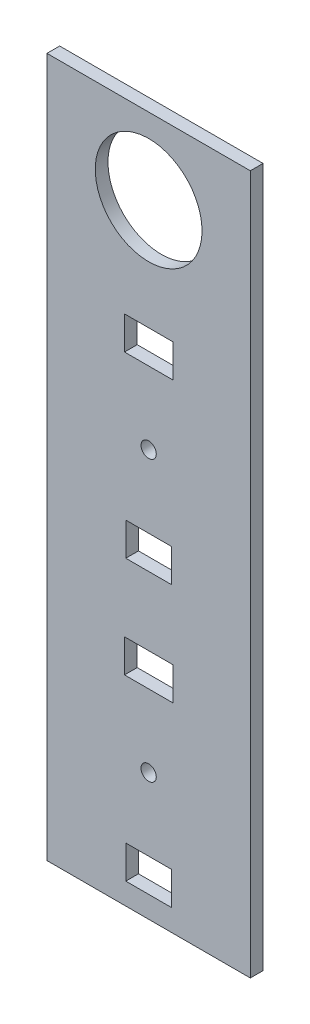
ISO-10303-21;
HEADER;
FILE_DESCRIPTION(('STEP AP214'),'2;1');
FILE_NAME('part.step','',(''),(''),'','','');
FILE_SCHEMA(('AUTOMOTIVE_DESIGN { 1 0 10303 214 1 1 1 1 }'));
ENDSEC;
DATA;
#1=APPLICATION_CONTEXT('core data for automotive mechanical design processes');
#2=APPLICATION_PROTOCOL_DEFINITION('international standard','automotive_design',2000,#1);
#3=PRODUCT_CONTEXT('',#1,'mechanical');
#4=PRODUCT('Part','Part','',(#3));
#5=PRODUCT_RELATED_PRODUCT_CATEGORY('part','',(#4));
#6=PRODUCT_DEFINITION_FORMATION('','',#4);
#7=PRODUCT_DEFINITION_CONTEXT('part definition',#1,'design');
#8=PRODUCT_DEFINITION('design','',#6,#7);
#9=PRODUCT_DEFINITION_SHAPE('','',#8);
#10=(LENGTH_UNIT() NAMED_UNIT(*) SI_UNIT(.MILLI.,.METRE.));
#11=(NAMED_UNIT(*) PLANE_ANGLE_UNIT() SI_UNIT($,.RADIAN.));
#12=(NAMED_UNIT(*) SI_UNIT($,.STERADIAN.) SOLID_ANGLE_UNIT());
#13=UNCERTAINTY_MEASURE_WITH_UNIT(LENGTH_MEASURE(1.E-05),#10,'distance_accuracy_value','');
#14=(GEOMETRIC_REPRESENTATION_CONTEXT(3) GLOBAL_UNCERTAINTY_ASSIGNED_CONTEXT((#13)) GLOBAL_UNIT_ASSIGNED_CONTEXT((#10,
#11,#12)) REPRESENTATION_CONTEXT('',''));
#15=CARTESIAN_POINT('',(0.,0.,0.));
#16=DIRECTION('',(0.,0.,1.));
#17=DIRECTION('',(1.,0.,0.));
#18=AXIS2_PLACEMENT_3D('',#15,#16,#17);
#19=CARTESIAN_POINT('',(-40.,137.5,-5.));
#20=DIRECTION('',(-1.,0.,0.));
#21=DIRECTION('',(0.,-1.,0.));
#22=AXIS2_PLACEMENT_3D('',#19,#20,#21);
#23=PLANE('',#22);
#24=DIRECTION('',(0.,-1.,0.));
#25=VECTOR('',#24,1.);
#26=CARTESIAN_POINT('',(-40.,137.5,0.));
#27=LINE('',#26,#25);
#28=CARTESIAN_POINT('',(-40.,137.5,0.));
#29=VERTEX_POINT('',#28);
#30=CARTESIAN_POINT('',(-40.,-137.5,0.));
#31=VERTEX_POINT('',#30);
#32=EDGE_CURVE('E316',#29,#31,#27,.T.);
#33=ORIENTED_EDGE('',*,*,#32,.F.);
#34=DIRECTION('',(0.,0.,1.));
#35=VECTOR('',#34,1.);
#36=CARTESIAN_POINT('',(-40.,137.5,-5.));
#37=LINE('',#36,#35);
#38=CARTESIAN_POINT('',(-40.,137.5,-5.));
#39=VERTEX_POINT('',#38);
#40=EDGE_CURVE('E11',#39,#29,#37,.T.);
#41=ORIENTED_EDGE('',*,*,#40,.F.);
#42=DIRECTION('',(0.,-1.,0.));
#43=VECTOR('',#42,1.);
#44=CARTESIAN_POINT('',(-40.,137.5,-5.));
#45=LINE('',#44,#43);
#46=CARTESIAN_POINT('',(-40.,-137.5,-5.));
#47=VERTEX_POINT('',#46);
#48=EDGE_CURVE('E319',#39,#47,#45,.T.);
#49=ORIENTED_EDGE('',*,*,#48,.T.);
#50=DIRECTION('',(0.,0.,1.));
#51=VECTOR('',#50,1.);
#52=CARTESIAN_POINT('',(-40.,-137.5,-5.));
#53=LINE('',#52,#51);
#54=EDGE_CURVE('E36',#47,#31,#53,.T.);
#55=ORIENTED_EDGE('',*,*,#54,.T.);
#56=EDGE_LOOP('',(#33,#41,#49,#55));
#57=FACE_BOUND('',#56,.T.);
#58=ADVANCED_FACE('F33',(#57),#23,.T.);
#59=CARTESIAN_POINT('',(-40.,137.5,-5.));
#60=DIRECTION('',(0.,1.,0.));
#61=DIRECTION('',(-1.,0.,0.));
#62=AXIS2_PLACEMENT_3D('',#59,#60,#61);
#63=PLANE('',#62);
#64=DIRECTION('',(-1.,0.,0.));
#65=VECTOR('',#64,1.);
#66=CARTESIAN_POINT('',(-40.,137.5,0.));
#67=LINE('',#66,#65);
#68=CARTESIAN_POINT('',(40.,137.5,0.));
#69=VERTEX_POINT('',#68);
#70=EDGE_CURVE('E323',#69,#29,#67,.T.);
#71=ORIENTED_EDGE('',*,*,#70,.F.);
#72=DIRECTION('',(0.,0.,1.));
#73=VECTOR('',#72,1.);
#74=CARTESIAN_POINT('',(40.,137.5,-5.));
#75=LINE('',#74,#73);
#76=CARTESIAN_POINT('',(40.,137.5,-5.));
#77=VERTEX_POINT('',#76);
#78=EDGE_CURVE('E41',#77,#69,#75,.T.);
#79=ORIENTED_EDGE('',*,*,#78,.F.);
#80=DIRECTION('',(-1.,0.,0.));
#81=VECTOR('',#80,1.);
#82=CARTESIAN_POINT('',(-40.,137.5,-5.));
#83=LINE('',#82,#81);
#84=EDGE_CURVE('E329',#77,#39,#83,.T.);
#85=ORIENTED_EDGE('',*,*,#84,.T.);
#86=ORIENTED_EDGE('',*,*,#40,.T.);
#87=EDGE_LOOP('',(#71,#79,#85,#86));
#88=FACE_BOUND('',#87,.T.);
#89=ADVANCED_FACE('F355',(#88),#63,.T.);
#90=CARTESIAN_POINT('',(40.,137.5,-5.));
#91=DIRECTION('',(1.,0.,0.));
#92=DIRECTION('',(0.,1.,0.));
#93=AXIS2_PLACEMENT_3D('',#90,#91,#92);
#94=PLANE('',#93);
#95=DIRECTION('',(0.,1.,0.));
#96=VECTOR('',#95,1.);
#97=CARTESIAN_POINT('',(40.,137.5,0.));
#98=LINE('',#97,#96);
#99=CARTESIAN_POINT('',(40.,-137.5,0.));
#100=VERTEX_POINT('',#99);
#101=EDGE_CURVE('E337',#100,#69,#98,.T.);
#102=ORIENTED_EDGE('',*,*,#101,.F.);
#103=DIRECTION('',(0.,0.,1.));
#104=VECTOR('',#103,1.);
#105=CARTESIAN_POINT('',(40.,-137.5,-5.));
#106=LINE('',#105,#104);
#107=CARTESIAN_POINT('',(40.,-137.5,-5.));
#108=VERTEX_POINT('',#107);
#109=EDGE_CURVE('E342',#108,#100,#106,.T.);
#110=ORIENTED_EDGE('',*,*,#109,.F.);
#111=DIRECTION('',(0.,1.,0.));
#112=VECTOR('',#111,1.);
#113=CARTESIAN_POINT('',(40.,137.5,-5.));
#114=LINE('',#113,#112);
#115=EDGE_CURVE('E326',#108,#77,#114,.T.);
#116=ORIENTED_EDGE('',*,*,#115,.T.);
#117=ORIENTED_EDGE('',*,*,#78,.T.);
#118=EDGE_LOOP('',(#102,#110,#116,#117));
#119=FACE_BOUND('',#118,.T.);
#120=ADVANCED_FACE('F360',(#119),#94,.T.);
#121=CARTESIAN_POINT('',(-40.,-137.5,-5.));
#122=DIRECTION('',(0.,-1.,0.));
#123=DIRECTION('',(0.,0.,-1.));
#124=AXIS2_PLACEMENT_3D('',#121,#122,#123);
#125=PLANE('',#124);
#126=DIRECTION('',(1.,0.,0.));
#127=VECTOR('',#126,1.);
#128=CARTESIAN_POINT('',(-40.,-137.5,0.));
#129=LINE('',#128,#127);
#130=EDGE_CURVE('E334',#31,#100,#129,.T.);
#131=ORIENTED_EDGE('',*,*,#130,.F.);
#132=ORIENTED_EDGE('',*,*,#54,.F.);
#133=DIRECTION('',(1.,0.,0.));
#134=VECTOR('',#133,1.);
#135=CARTESIAN_POINT('',(-40.,-137.5,-5.));
#136=LINE('',#135,#134);
#137=EDGE_CURVE('E322',#47,#108,#136,.T.);
#138=ORIENTED_EDGE('',*,*,#137,.T.);
#139=ORIENTED_EDGE('',*,*,#109,.T.);
#140=EDGE_LOOP('',(#131,#132,#138,#139));
#141=FACE_BOUND('',#140,.T.);
#142=ADVANCED_FACE('F350',(#141),#125,.T.);
#143=CARTESIAN_POINT('',(0.,0.,-5.));
#144=DIRECTION('',(0.,0.,1.));
#145=DIRECTION('',(1.,0.,0.));
#146=AXIS2_PLACEMENT_3D('',#143,#144,#145);
#147=PLANE('',#146);
#148=CARTESIAN_POINT('',(0.,-87.5,-5.));
#149=DIRECTION('',(0.,0.,1.));
#150=DIRECTION('',(1.,0.,0.));
#151=AXIS2_PLACEMENT_3D('',#148,#149,#150);
#152=CIRCLE('',#151,3.);
#153=CARTESIAN_POINT('',(3.00000000000001,-87.5,-5.));
#154=VERTEX_POINT('',#153);
#155=EDGE_CURVE('E201',#154,#154,#152,.T.);
#156=ORIENTED_EDGE('',*,*,#155,.T.);
#157=EDGE_LOOP('',(#156));
#158=FACE_BOUND('',#157,.T.);
#159=DIRECTION('',(-1.,0.,0.));
#160=VECTOR('',#159,1.);
#161=CARTESIAN_POINT('',(-9.49999999999998,-46.,-5.));
#162=LINE('',#161,#160);
#163=CARTESIAN_POINT('',(9.50000000000002,-46.,-5.));
#164=VERTEX_POINT('',#163);
#165=CARTESIAN_POINT('',(-9.49999999999998,-46.,-5.));
#166=VERTEX_POINT('',#165);
#167=EDGE_CURVE('E178',#164,#166,#162,.T.);
#168=ORIENTED_EDGE('',*,*,#167,.T.);
#169=DIRECTION('',(0.,-1.,0.));
#170=VECTOR('',#169,1.);
#171=CARTESIAN_POINT('',(-9.49999999999998,-46.,-5.));
#172=LINE('',#171,#170);
#173=CARTESIAN_POINT('',(-9.49999999999998,-59.,-5.));
#174=VERTEX_POINT('',#173);
#175=EDGE_CURVE('E172',#166,#174,#172,.T.);
#176=ORIENTED_EDGE('',*,*,#175,.T.);
#177=DIRECTION('',(1.,0.,0.));
#178=VECTOR('',#177,1.);
#179=CARTESIAN_POINT('',(-9.49999999999998,-59.,-5.));
#180=LINE('',#179,#178);
#181=CARTESIAN_POINT('',(9.50000000000003,-59.,-5.));
#182=VERTEX_POINT('',#181);
#183=EDGE_CURVE('E181',#174,#182,#180,.T.);
#184=ORIENTED_EDGE('',*,*,#183,.T.);
#185=DIRECTION('',(0.,1.,0.));
#186=VECTOR('',#185,1.);
#187=CARTESIAN_POINT('',(9.50000000000002,-46.,-5.));
#188=LINE('',#187,#186);
#189=EDGE_CURVE('E49',#182,#164,#188,.T.);
#190=ORIENTED_EDGE('',*,*,#189,.T.);
#191=EDGE_LOOP('',(#168,#176,#184,#190));
#192=FACE_BOUND('',#191,.T.);
#193=DIRECTION('',(-1.,0.,0.));
#194=VECTOR('',#193,1.);
#195=CARTESIAN_POINT('',(-8.99999999999998,-5.99999999999998,-5.));
#196=LINE('',#195,#194);
#197=CARTESIAN_POINT('',(9.00000000000002,-5.99999999999998,-5.));
#198=VERTEX_POINT('',#197);
#199=CARTESIAN_POINT('',(-8.99999999999998,-5.99999999999998,-5.));
#200=VERTEX_POINT('',#199);
#201=EDGE_CURVE('E221',#198,#200,#196,.T.);
#202=ORIENTED_EDGE('',*,*,#201,.T.);
#203=DIRECTION('',(0.,-1.,0.));
#204=VECTOR('',#203,1.);
#205=CARTESIAN_POINT('',(-8.99999999999998,-5.99999999999998,-5.));
#206=LINE('',#205,#204);
#207=CARTESIAN_POINT('',(-8.99999999999998,-19.,-5.));
#208=VERTEX_POINT('',#207);
#209=EDGE_CURVE('E211',#200,#208,#206,.T.);
#210=ORIENTED_EDGE('',*,*,#209,.T.);
#211=DIRECTION('',(1.,0.,0.));
#212=VECTOR('',#211,1.);
#213=CARTESIAN_POINT('',(-8.99999999999998,-19.,-5.));
#214=LINE('',#213,#212);
#215=CARTESIAN_POINT('',(9.00000000000002,-19.,-5.));
#216=VERTEX_POINT('',#215);
#217=EDGE_CURVE('E214',#208,#216,#214,.T.);
#218=ORIENTED_EDGE('',*,*,#217,.T.);
#219=DIRECTION('',(0.,1.,0.));
#220=VECTOR('',#219,1.);
#221=CARTESIAN_POINT('',(9.00000000000002,-5.99999999999998,-5.));
#222=LINE('',#221,#220);
#223=EDGE_CURVE('E218',#216,#198,#222,.T.);
#224=ORIENTED_EDGE('',*,*,#223,.T.);
#225=EDGE_LOOP('',(#202,#210,#218,#224));
#226=FACE_BOUND('',#225,.T.);
#227=CARTESIAN_POINT('',(0.,22.5,-5.));
#228=DIRECTION('',(0.,0.,1.));
#229=DIRECTION('',(1.,0.,0.));
#230=AXIS2_PLACEMENT_3D('',#227,#228,#229);
#231=CIRCLE('',#230,3.);
#232=CARTESIAN_POINT('',(3.,22.5,-5.));
#233=VERTEX_POINT('',#232);
#234=EDGE_CURVE('E243',#233,#233,#231,.T.);
#235=ORIENTED_EDGE('',*,*,#234,.T.);
#236=EDGE_LOOP('',(#235));
#237=FACE_BOUND('',#236,.T.);
#238=DIRECTION('',(-1.,0.,0.));
#239=VECTOR('',#238,1.);
#240=CARTESIAN_POINT('',(-9.49999999999999,64.,-5.));
#241=LINE('',#240,#239);
#242=CARTESIAN_POINT('',(9.50000000000001,64.,-5.));
#243=VERTEX_POINT('',#242);
#244=CARTESIAN_POINT('',(-9.49999999999999,64.,-5.));
#245=VERTEX_POINT('',#244);
#246=EDGE_CURVE('E259',#243,#245,#241,.T.);
#247=ORIENTED_EDGE('',*,*,#246,.T.);
#248=DIRECTION('',(0.,-1.,0.));
#249=VECTOR('',#248,1.);
#250=CARTESIAN_POINT('',(-9.49999999999999,64.,-5.));
#251=LINE('',#250,#249);
#252=CARTESIAN_POINT('',(-9.49999999999999,51.,-5.));
#253=VERTEX_POINT('',#252);
#254=EDGE_CURVE('E249',#245,#253,#251,.T.);
#255=ORIENTED_EDGE('',*,*,#254,.T.);
#256=DIRECTION('',(1.,0.,0.));
#257=VECTOR('',#256,1.);
#258=CARTESIAN_POINT('',(-9.49999999999999,51.,-5.));
#259=LINE('',#258,#257);
#260=CARTESIAN_POINT('',(9.50000000000001,51.,-5.));
#261=VERTEX_POINT('',#260);
#262=EDGE_CURVE('E252',#253,#261,#259,.T.);
#263=ORIENTED_EDGE('',*,*,#262,.T.);
#264=DIRECTION('',(0.,1.,0.));
#265=VECTOR('',#264,1.);
#266=CARTESIAN_POINT('',(9.50000000000001,64.,-5.));
#267=LINE('',#266,#265);
#268=EDGE_CURVE('E256',#261,#243,#267,.T.);
#269=ORIENTED_EDGE('',*,*,#268,.T.);
#270=EDGE_LOOP('',(#247,#255,#263,#269));
#271=FACE_BOUND('',#270,.T.);
#272=DIRECTION('',(-1.,0.,0.));
#273=VECTOR('',#272,1.);
#274=CARTESIAN_POINT('',(-8.99999999999997,-116.,-5.));
#275=LINE('',#274,#273);
#276=CARTESIAN_POINT('',(9.00000000000003,-116.,-5.));
#277=VERTEX_POINT('',#276);
#278=CARTESIAN_POINT('',(-8.99999999999997,-116.,-5.));
#279=VERTEX_POINT('',#278);
#280=EDGE_CURVE('E291',#277,#279,#275,.T.);
#281=ORIENTED_EDGE('',*,*,#280,.T.);
#282=DIRECTION('',(0.,-1.,0.));
#283=VECTOR('',#282,1.);
#284=CARTESIAN_POINT('',(-8.99999999999997,-116.,-5.));
#285=LINE('',#284,#283);
#286=CARTESIAN_POINT('',(-8.99999999999997,-129.,-5.));
#287=VERTEX_POINT('',#286);
#288=EDGE_CURVE('E281',#279,#287,#285,.T.);
#289=ORIENTED_EDGE('',*,*,#288,.T.);
#290=DIRECTION('',(1.,0.,0.));
#291=VECTOR('',#290,1.);
#292=CARTESIAN_POINT('',(-8.99999999999997,-129.,-5.));
#293=LINE('',#292,#291);
#294=CARTESIAN_POINT('',(9.00000000000003,-129.,-5.));
#295=VERTEX_POINT('',#294);
#296=EDGE_CURVE('E284',#287,#295,#293,.T.);
#297=ORIENTED_EDGE('',*,*,#296,.T.);
#298=DIRECTION('',(0.,1.,0.));
#299=VECTOR('',#298,1.);
#300=CARTESIAN_POINT('',(9.00000000000003,-116.,-5.));
#301=LINE('',#300,#299);
#302=EDGE_CURVE('E288',#295,#277,#301,.T.);
#303=ORIENTED_EDGE('',*,*,#302,.T.);
#304=EDGE_LOOP('',(#281,#289,#297,#303));
#305=FACE_BOUND('',#304,.T.);
#306=CARTESIAN_POINT('',(0.,107.5,-5.));
#307=DIRECTION('',(0.,0.,1.));
#308=DIRECTION('',(1.,0.,0.));
#309=AXIS2_PLACEMENT_3D('',#306,#307,#308);
#310=CIRCLE('',#309,21.);
#311=CARTESIAN_POINT('',(21.,107.5,-5.));
#312=VERTEX_POINT('',#311);
#313=EDGE_CURVE('E313',#312,#312,#310,.T.);
#314=ORIENTED_EDGE('',*,*,#313,.T.);
#315=EDGE_LOOP('',(#314));
#316=FACE_BOUND('',#315,.T.);
#317=ORIENTED_EDGE('',*,*,#48,.F.);
#318=ORIENTED_EDGE('',*,*,#84,.F.);
#319=ORIENTED_EDGE('',*,*,#115,.F.);
#320=ORIENTED_EDGE('',*,*,#137,.F.);
#321=EDGE_LOOP('',(#317,#318,#319,#320));
#322=FACE_BOUND('',#321,.T.);
#323=ADVANCED_FACE('F185',(#158,#192,#226,#237,#271,#305,#316,#322),#147,.F.);
#324=CARTESIAN_POINT('',(0.,0.,0.));
#325=DIRECTION('',(0.,0.,1.));
#326=DIRECTION('',(1.,0.,0.));
#327=AXIS2_PLACEMENT_3D('',#324,#325,#326);
#328=PLANE('',#327);
#329=CARTESIAN_POINT('',(0.,-87.5,0.));
#330=DIRECTION('',(0.,0.,1.));
#331=DIRECTION('',(1.,0.,0.));
#332=AXIS2_PLACEMENT_3D('',#329,#330,#331);
#333=CIRCLE('',#332,3.);
#334=CARTESIAN_POINT('',(3.00000000000001,-87.5,0.));
#335=VERTEX_POINT('',#334);
#336=EDGE_CURVE('E194',#335,#335,#333,.T.);
#337=ORIENTED_EDGE('',*,*,#336,.F.);
#338=EDGE_LOOP('',(#337));
#339=FACE_BOUND('',#338,.T.);
#340=DIRECTION('',(0.,-1.,0.));
#341=VECTOR('',#340,1.);
#342=CARTESIAN_POINT('',(-9.49999999999998,-46.,0.));
#343=LINE('',#342,#341);
#344=CARTESIAN_POINT('',(-9.49999999999998,-46.,0.));
#345=VERTEX_POINT('',#344);
#346=CARTESIAN_POINT('',(-9.49999999999998,-59.,0.));
#347=VERTEX_POINT('',#346);
#348=EDGE_CURVE('E57',#345,#347,#343,.T.);
#349=ORIENTED_EDGE('',*,*,#348,.F.);
#350=DIRECTION('',(-1.,0.,0.));
#351=VECTOR('',#350,1.);
#352=CARTESIAN_POINT('',(-9.49999999999998,-46.,0.));
#353=LINE('',#352,#351);
#354=CARTESIAN_POINT('',(9.50000000000002,-46.,0.));
#355=VERTEX_POINT('',#354);
#356=EDGE_CURVE('E188',#355,#345,#353,.T.);
#357=ORIENTED_EDGE('',*,*,#356,.F.);
#358=DIRECTION('',(0.,1.,0.));
#359=VECTOR('',#358,1.);
#360=CARTESIAN_POINT('',(9.50000000000002,-46.,0.));
#361=LINE('',#360,#359);
#362=CARTESIAN_POINT('',(9.50000000000003,-59.,0.));
#363=VERTEX_POINT('',#362);
#364=EDGE_CURVE('E191',#363,#355,#361,.T.);
#365=ORIENTED_EDGE('',*,*,#364,.F.);
#366=DIRECTION('',(1.,0.,0.));
#367=VECTOR('',#366,1.);
#368=CARTESIAN_POINT('',(-9.49999999999998,-59.,0.));
#369=LINE('',#368,#367);
#370=EDGE_CURVE('E200',#347,#363,#369,.T.);
#371=ORIENTED_EDGE('',*,*,#370,.F.);
#372=EDGE_LOOP('',(#349,#357,#365,#371));
#373=FACE_BOUND('',#372,.T.);
#374=DIRECTION('',(0.,-1.,0.));
#375=VECTOR('',#374,1.);
#376=CARTESIAN_POINT('',(-8.99999999999998,-5.99999999999998,0.));
#377=LINE('',#376,#375);
#378=CARTESIAN_POINT('',(-8.99999999999998,-5.99999999999998,0.));
#379=VERTEX_POINT('',#378);
#380=CARTESIAN_POINT('',(-8.99999999999998,-19.,0.));
#381=VERTEX_POINT('',#380);
#382=EDGE_CURVE('E207',#379,#381,#377,.T.);
#383=ORIENTED_EDGE('',*,*,#382,.F.);
#384=DIRECTION('',(-1.,0.,0.));
#385=VECTOR('',#384,1.);
#386=CARTESIAN_POINT('',(-8.99999999999998,-5.99999999999998,0.));
#387=LINE('',#386,#385);
#388=CARTESIAN_POINT('',(9.00000000000002,-5.99999999999998,0.));
#389=VERTEX_POINT('',#388);
#390=EDGE_CURVE('E215',#389,#379,#387,.T.);
#391=ORIENTED_EDGE('',*,*,#390,.F.);
#392=DIRECTION('',(0.,1.,0.));
#393=VECTOR('',#392,1.);
#394=CARTESIAN_POINT('',(9.00000000000002,-5.99999999999998,0.));
#395=LINE('',#394,#393);
#396=CARTESIAN_POINT('',(9.00000000000002,-19.,0.));
#397=VERTEX_POINT('',#396);
#398=EDGE_CURVE('E229',#397,#389,#395,.T.);
#399=ORIENTED_EDGE('',*,*,#398,.F.);
#400=DIRECTION('',(1.,0.,0.));
#401=VECTOR('',#400,1.);
#402=CARTESIAN_POINT('',(-8.99999999999998,-19.,0.));
#403=LINE('',#402,#401);
#404=EDGE_CURVE('E226',#381,#397,#403,.T.);
#405=ORIENTED_EDGE('',*,*,#404,.F.);
#406=EDGE_LOOP('',(#383,#391,#399,#405));
#407=FACE_BOUND('',#406,.T.);
#408=CARTESIAN_POINT('',(0.,22.5,0.));
#409=DIRECTION('',(0.,0.,1.));
#410=DIRECTION('',(1.,0.,0.));
#411=AXIS2_PLACEMENT_3D('',#408,#409,#410);
#412=CIRCLE('',#411,3.);
#413=CARTESIAN_POINT('',(3.,22.5,0.));
#414=VERTEX_POINT('',#413);
#415=EDGE_CURVE('E236',#414,#414,#412,.T.);
#416=ORIENTED_EDGE('',*,*,#415,.F.);
#417=EDGE_LOOP('',(#416));
#418=FACE_BOUND('',#417,.T.);
#419=DIRECTION('',(0.,-1.,0.));
#420=VECTOR('',#419,1.);
#421=CARTESIAN_POINT('',(-9.49999999999999,64.,0.));
#422=LINE('',#421,#420);
#423=CARTESIAN_POINT('',(-9.49999999999999,64.,0.));
#424=VERTEX_POINT('',#423);
#425=CARTESIAN_POINT('',(-9.49999999999999,51.,0.));
#426=VERTEX_POINT('',#425);
#427=EDGE_CURVE('E246',#424,#426,#422,.T.);
#428=ORIENTED_EDGE('',*,*,#427,.F.);
#429=DIRECTION('',(-1.,0.,0.));
#430=VECTOR('',#429,1.);
#431=CARTESIAN_POINT('',(-9.49999999999999,64.,0.));
#432=LINE('',#431,#430);
#433=CARTESIAN_POINT('',(9.50000000000001,64.,0.));
#434=VERTEX_POINT('',#433);
#435=EDGE_CURVE('E253',#434,#424,#432,.T.);
#436=ORIENTED_EDGE('',*,*,#435,.F.);
#437=DIRECTION('',(0.,1.,0.));
#438=VECTOR('',#437,1.);
#439=CARTESIAN_POINT('',(9.50000000000001,64.,0.));
#440=LINE('',#439,#438);
#441=CARTESIAN_POINT('',(9.50000000000001,51.,0.));
#442=VERTEX_POINT('',#441);
#443=EDGE_CURVE('E267',#442,#434,#440,.T.);
#444=ORIENTED_EDGE('',*,*,#443,.F.);
#445=DIRECTION('',(1.,0.,0.));
#446=VECTOR('',#445,1.);
#447=CARTESIAN_POINT('',(-9.49999999999999,51.,0.));
#448=LINE('',#447,#446);
#449=EDGE_CURVE('E264',#426,#442,#448,.T.);
#450=ORIENTED_EDGE('',*,*,#449,.F.);
#451=EDGE_LOOP('',(#428,#436,#444,#450));
#452=FACE_BOUND('',#451,.T.);
#453=DIRECTION('',(0.,-1.,0.));
#454=VECTOR('',#453,1.);
#455=CARTESIAN_POINT('',(-8.99999999999997,-116.,0.));
#456=LINE('',#455,#454);
#457=CARTESIAN_POINT('',(-8.99999999999997,-116.,0.));
#458=VERTEX_POINT('',#457);
#459=CARTESIAN_POINT('',(-8.99999999999997,-129.,0.));
#460=VERTEX_POINT('',#459);
#461=EDGE_CURVE('E274',#458,#460,#456,.T.);
#462=ORIENTED_EDGE('',*,*,#461,.F.);
#463=DIRECTION('',(-1.,0.,0.));
#464=VECTOR('',#463,1.);
#465=CARTESIAN_POINT('',(-8.99999999999997,-116.,0.));
#466=LINE('',#465,#464);
#467=CARTESIAN_POINT('',(9.00000000000003,-116.,0.));
#468=VERTEX_POINT('',#467);
#469=EDGE_CURVE('E285',#468,#458,#466,.T.);
#470=ORIENTED_EDGE('',*,*,#469,.F.);
#471=DIRECTION('',(0.,1.,0.));
#472=VECTOR('',#471,1.);
#473=CARTESIAN_POINT('',(9.00000000000003,-116.,0.));
#474=LINE('',#473,#472);
#475=CARTESIAN_POINT('',(9.00000000000003,-129.,0.));
#476=VERTEX_POINT('',#475);
#477=EDGE_CURVE('E299',#476,#468,#474,.T.);
#478=ORIENTED_EDGE('',*,*,#477,.F.);
#479=DIRECTION('',(1.,0.,0.));
#480=VECTOR('',#479,1.);
#481=CARTESIAN_POINT('',(-8.99999999999997,-129.,0.));
#482=LINE('',#481,#480);
#483=EDGE_CURVE('E296',#460,#476,#482,.T.);
#484=ORIENTED_EDGE('',*,*,#483,.F.);
#485=EDGE_LOOP('',(#462,#470,#478,#484));
#486=FACE_BOUND('',#485,.T.);
#487=CARTESIAN_POINT('',(0.,107.5,0.));
#488=DIRECTION('',(0.,0.,1.));
#489=DIRECTION('',(1.,0.,0.));
#490=AXIS2_PLACEMENT_3D('',#487,#488,#489);
#491=CIRCLE('',#490,21.);
#492=CARTESIAN_POINT('',(21.,107.5,0.));
#493=VERTEX_POINT('',#492);
#494=EDGE_CURVE('E306',#493,#493,#491,.T.);
#495=ORIENTED_EDGE('',*,*,#494,.F.);
#496=EDGE_LOOP('',(#495));
#497=FACE_BOUND('',#496,.T.);
#498=ORIENTED_EDGE('',*,*,#32,.T.);
#499=ORIENTED_EDGE('',*,*,#130,.T.);
#500=ORIENTED_EDGE('',*,*,#101,.T.);
#501=ORIENTED_EDGE('',*,*,#70,.T.);
#502=EDGE_LOOP('',(#498,#499,#500,#501));
#503=FACE_BOUND('',#502,.T.);
#504=ADVANCED_FACE('F352',(#339,#373,#407,#418,#452,#486,#497,#503),#328,.T.);
#505=CARTESIAN_POINT('',(0.,107.5,-5.));
#506=DIRECTION('',(0.,0.,1.));
#507=DIRECTION('',(1.,0.,0.));
#508=AXIS2_PLACEMENT_3D('',#505,#506,#507);
#509=CYLINDRICAL_SURFACE('',#508,21.);
#510=ORIENTED_EDGE('',*,*,#313,.F.);
#511=EDGE_LOOP('',(#510));
#512=FACE_BOUND('',#511,.T.);
#513=ORIENTED_EDGE('',*,*,#494,.T.);
#514=EDGE_LOOP('',(#513));
#515=FACE_BOUND('',#514,.T.);
#516=ADVANCED_FACE('F403',(#512,#515),#509,.F.);
#517=CARTESIAN_POINT('',(-8.99999999999997,-116.,-5.));
#518=DIRECTION('',(-1.,0.,0.));
#519=DIRECTION('',(0.,-1.,0.));
#520=AXIS2_PLACEMENT_3D('',#517,#518,#519);
#521=PLANE('',#520);
#522=ORIENTED_EDGE('',*,*,#461,.T.);
#523=DIRECTION('',(0.,0.,1.));
#524=VECTOR('',#523,1.);
#525=CARTESIAN_POINT('',(-8.99999999999997,-129.,-5.));
#526=LINE('',#525,#524);
#527=EDGE_CURVE('E294',#287,#460,#526,.T.);
#528=ORIENTED_EDGE('',*,*,#527,.F.);
#529=ORIENTED_EDGE('',*,*,#288,.F.);
#530=DIRECTION('',(0.,0.,1.));
#531=VECTOR('',#530,1.);
#532=CARTESIAN_POINT('',(-8.99999999999997,-116.,-5.));
#533=LINE('',#532,#531);
#534=EDGE_CURVE('E304',#279,#458,#533,.T.);
#535=ORIENTED_EDGE('',*,*,#534,.T.);
#536=EDGE_LOOP('',(#522,#528,#529,#535));
#537=FACE_BOUND('',#536,.T.);
#538=ADVANCED_FACE('F413',(#537),#521,.F.);
#539=CARTESIAN_POINT('',(-8.99999999999997,-116.,-5.));
#540=DIRECTION('',(0.,1.,0.));
#541=DIRECTION('',(-1.,0.,0.));
#542=AXIS2_PLACEMENT_3D('',#539,#540,#541);
#543=PLANE('',#542);
#544=ORIENTED_EDGE('',*,*,#469,.T.);
#545=ORIENTED_EDGE('',*,*,#534,.F.);
#546=ORIENTED_EDGE('',*,*,#280,.F.);
#547=DIRECTION('',(0.,0.,1.));
#548=VECTOR('',#547,1.);
#549=CARTESIAN_POINT('',(9.00000000000003,-116.,-5.));
#550=LINE('',#549,#548);
#551=EDGE_CURVE('E307',#277,#468,#550,.T.);
#552=ORIENTED_EDGE('',*,*,#551,.T.);
#553=EDGE_LOOP('',(#544,#545,#546,#552));
#554=FACE_BOUND('',#553,.T.);
#555=ADVANCED_FACE('F423',(#554),#543,.F.);
#556=CARTESIAN_POINT('',(9.00000000000003,-116.,-5.));
#557=DIRECTION('',(1.,0.,0.));
#558=DIRECTION('',(0.,1.,0.));
#559=AXIS2_PLACEMENT_3D('',#556,#557,#558);
#560=PLANE('',#559);
#561=ORIENTED_EDGE('',*,*,#477,.T.);
#562=ORIENTED_EDGE('',*,*,#551,.F.);
#563=ORIENTED_EDGE('',*,*,#302,.F.);
#564=DIRECTION('',(0.,0.,1.));
#565=VECTOR('',#564,1.);
#566=CARTESIAN_POINT('',(9.00000000000003,-129.,-5.));
#567=LINE('',#566,#565);
#568=EDGE_CURVE('E309',#295,#476,#567,.T.);
#569=ORIENTED_EDGE('',*,*,#568,.T.);
#570=EDGE_LOOP('',(#561,#562,#563,#569));
#571=FACE_BOUND('',#570,.T.);
#572=ADVANCED_FACE('F433',(#571),#560,.F.);
#573=CARTESIAN_POINT('',(-8.99999999999997,-129.,-5.));
#574=DIRECTION('',(0.,-1.,0.));
#575=DIRECTION('',(0.,0.,-1.));
#576=AXIS2_PLACEMENT_3D('',#573,#574,#575);
#577=PLANE('',#576);
#578=ORIENTED_EDGE('',*,*,#483,.T.);
#579=ORIENTED_EDGE('',*,*,#568,.F.);
#580=ORIENTED_EDGE('',*,*,#296,.F.);
#581=ORIENTED_EDGE('',*,*,#527,.T.);
#582=EDGE_LOOP('',(#578,#579,#580,#581));
#583=FACE_BOUND('',#582,.T.);
#584=ADVANCED_FACE('F443',(#583),#577,.F.);
#585=CARTESIAN_POINT('',(-9.49999999999999,64.,-5.));
#586=DIRECTION('',(-1.,0.,0.));
#587=DIRECTION('',(0.,-1.,0.));
#588=AXIS2_PLACEMENT_3D('',#585,#586,#587);
#589=PLANE('',#588);
#590=ORIENTED_EDGE('',*,*,#427,.T.);
#591=DIRECTION('',(0.,0.,1.));
#592=VECTOR('',#591,1.);
#593=CARTESIAN_POINT('',(-9.49999999999999,51.,-5.));
#594=LINE('',#593,#592);
#595=EDGE_CURVE('E262',#253,#426,#594,.T.);
#596=ORIENTED_EDGE('',*,*,#595,.F.);
#597=ORIENTED_EDGE('',*,*,#254,.F.);
#598=DIRECTION('',(0.,0.,1.));
#599=VECTOR('',#598,1.);
#600=CARTESIAN_POINT('',(-9.49999999999999,64.,-5.));
#601=LINE('',#600,#599);
#602=EDGE_CURVE('E272',#245,#424,#601,.T.);
#603=ORIENTED_EDGE('',*,*,#602,.T.);
#604=EDGE_LOOP('',(#590,#596,#597,#603));
#605=FACE_BOUND('',#604,.T.);
#606=ADVANCED_FACE('F453',(#605),#589,.F.);
#607=CARTESIAN_POINT('',(-9.49999999999999,64.,-5.));
#608=DIRECTION('',(0.,1.,0.));
#609=DIRECTION('',(-1.,0.,0.));
#610=AXIS2_PLACEMENT_3D('',#607,#608,#609);
#611=PLANE('',#610);
#612=ORIENTED_EDGE('',*,*,#435,.T.);
#613=ORIENTED_EDGE('',*,*,#602,.F.);
#614=ORIENTED_EDGE('',*,*,#246,.F.);
#615=DIRECTION('',(0.,0.,1.));
#616=VECTOR('',#615,1.);
#617=CARTESIAN_POINT('',(9.50000000000001,64.,-5.));
#618=LINE('',#617,#616);
#619=EDGE_CURVE('E275',#243,#434,#618,.T.);
#620=ORIENTED_EDGE('',*,*,#619,.T.);
#621=EDGE_LOOP('',(#612,#613,#614,#620));
#622=FACE_BOUND('',#621,.T.);
#623=ADVANCED_FACE('F463',(#622),#611,.F.);
#624=CARTESIAN_POINT('',(9.50000000000001,64.,-5.));
#625=DIRECTION('',(1.,0.,0.));
#626=DIRECTION('',(0.,1.,0.));
#627=AXIS2_PLACEMENT_3D('',#624,#625,#626);
#628=PLANE('',#627);
#629=ORIENTED_EDGE('',*,*,#443,.T.);
#630=ORIENTED_EDGE('',*,*,#619,.F.);
#631=ORIENTED_EDGE('',*,*,#268,.F.);
#632=DIRECTION('',(0.,0.,1.));
#633=VECTOR('',#632,1.);
#634=CARTESIAN_POINT('',(9.50000000000001,51.,-5.));
#635=LINE('',#634,#633);
#636=EDGE_CURVE('E277',#261,#442,#635,.T.);
#637=ORIENTED_EDGE('',*,*,#636,.T.);
#638=EDGE_LOOP('',(#629,#630,#631,#637));
#639=FACE_BOUND('',#638,.T.);
#640=ADVANCED_FACE('F473',(#639),#628,.F.);
#641=CARTESIAN_POINT('',(-9.49999999999999,51.,-5.));
#642=DIRECTION('',(0.,-1.,0.));
#643=DIRECTION('',(0.,0.,-1.));
#644=AXIS2_PLACEMENT_3D('',#641,#642,#643);
#645=PLANE('',#644);
#646=ORIENTED_EDGE('',*,*,#449,.T.);
#647=ORIENTED_EDGE('',*,*,#636,.F.);
#648=ORIENTED_EDGE('',*,*,#262,.F.);
#649=ORIENTED_EDGE('',*,*,#595,.T.);
#650=EDGE_LOOP('',(#646,#647,#648,#649));
#651=FACE_BOUND('',#650,.T.);
#652=ADVANCED_FACE('F483',(#651),#645,.F.);
#653=CARTESIAN_POINT('',(0.,22.5,-5.));
#654=DIRECTION('',(0.,0.,1.));
#655=DIRECTION('',(1.,0.,0.));
#656=AXIS2_PLACEMENT_3D('',#653,#654,#655);
#657=CYLINDRICAL_SURFACE('',#656,3.);
#658=ORIENTED_EDGE('',*,*,#234,.F.);
#659=EDGE_LOOP('',(#658));
#660=FACE_BOUND('',#659,.T.);
#661=ORIENTED_EDGE('',*,*,#415,.T.);
#662=EDGE_LOOP('',(#661));
#663=FACE_BOUND('',#662,.T.);
#664=ADVANCED_FACE('F493',(#660,#663),#657,.F.);
#665=CARTESIAN_POINT('',(-8.99999999999998,-5.99999999999998,-5.));
#666=DIRECTION('',(-1.,0.,0.));
#667=DIRECTION('',(0.,-1.,0.));
#668=AXIS2_PLACEMENT_3D('',#665,#666,#667);
#669=PLANE('',#668);
#670=ORIENTED_EDGE('',*,*,#382,.T.);
#671=DIRECTION('',(0.,0.,1.));
#672=VECTOR('',#671,1.);
#673=CARTESIAN_POINT('',(-8.99999999999998,-19.,-5.));
#674=LINE('',#673,#672);
#675=EDGE_CURVE('E224',#208,#381,#674,.T.);
#676=ORIENTED_EDGE('',*,*,#675,.F.);
#677=ORIENTED_EDGE('',*,*,#209,.F.);
#678=DIRECTION('',(0.,0.,1.));
#679=VECTOR('',#678,1.);
#680=CARTESIAN_POINT('',(-8.99999999999998,-5.99999999999998,-5.));
#681=LINE('',#680,#679);
#682=EDGE_CURVE('E234',#200,#379,#681,.T.);
#683=ORIENTED_EDGE('',*,*,#682,.T.);
#684=EDGE_LOOP('',(#670,#676,#677,#683));
#685=FACE_BOUND('',#684,.T.);
#686=ADVANCED_FACE('F503',(#685),#669,.F.);
#687=CARTESIAN_POINT('',(-8.99999999999998,-5.99999999999998,-5.));
#688=DIRECTION('',(0.,1.,0.));
#689=DIRECTION('',(0.,0.,1.));
#690=AXIS2_PLACEMENT_3D('',#687,#688,#689);
#691=PLANE('',#690);
#692=ORIENTED_EDGE('',*,*,#390,.T.);
#693=ORIENTED_EDGE('',*,*,#682,.F.);
#694=ORIENTED_EDGE('',*,*,#201,.F.);
#695=DIRECTION('',(0.,0.,1.));
#696=VECTOR('',#695,1.);
#697=CARTESIAN_POINT('',(9.00000000000002,-5.99999999999998,-5.));
#698=LINE('',#697,#696);
#699=EDGE_CURVE('E237',#198,#389,#698,.T.);
#700=ORIENTED_EDGE('',*,*,#699,.T.);
#701=EDGE_LOOP('',(#692,#693,#694,#700));
#702=FACE_BOUND('',#701,.T.);
#703=ADVANCED_FACE('F513',(#702),#691,.F.);
#704=CARTESIAN_POINT('',(9.00000000000002,-5.99999999999998,-5.));
#705=DIRECTION('',(1.,0.,0.));
#706=DIRECTION('',(0.,1.,0.));
#707=AXIS2_PLACEMENT_3D('',#704,#705,#706);
#708=PLANE('',#707);
#709=ORIENTED_EDGE('',*,*,#398,.T.);
#710=ORIENTED_EDGE('',*,*,#699,.F.);
#711=ORIENTED_EDGE('',*,*,#223,.F.);
#712=DIRECTION('',(0.,0.,1.));
#713=VECTOR('',#712,1.);
#714=CARTESIAN_POINT('',(9.00000000000002,-19.,-5.));
#715=LINE('',#714,#713);
#716=EDGE_CURVE('E239',#216,#397,#715,.T.);
#717=ORIENTED_EDGE('',*,*,#716,.T.);
#718=EDGE_LOOP('',(#709,#710,#711,#717));
#719=FACE_BOUND('',#718,.T.);
#720=ADVANCED_FACE('F523',(#719),#708,.F.);
#721=CARTESIAN_POINT('',(-8.99999999999998,-19.,-5.));
#722=DIRECTION('',(0.,-1.,0.));
#723=DIRECTION('',(0.,0.,-1.));
#724=AXIS2_PLACEMENT_3D('',#721,#722,#723);
#725=PLANE('',#724);
#726=ORIENTED_EDGE('',*,*,#404,.T.);
#727=ORIENTED_EDGE('',*,*,#716,.F.);
#728=ORIENTED_EDGE('',*,*,#217,.F.);
#729=ORIENTED_EDGE('',*,*,#675,.T.);
#730=EDGE_LOOP('',(#726,#727,#728,#729));
#731=FACE_BOUND('',#730,.T.);
#732=ADVANCED_FACE('F533',(#731),#725,.F.);
#733=CARTESIAN_POINT('',(-9.49999999999998,-46.,-5.));
#734=DIRECTION('',(-1.,0.,0.));
#735=DIRECTION('',(0.,-1.,0.));
#736=AXIS2_PLACEMENT_3D('',#733,#734,#735);
#737=PLANE('',#736);
#738=ORIENTED_EDGE('',*,*,#348,.T.);
#739=DIRECTION('',(0.,0.,1.));
#740=VECTOR('',#739,1.);
#741=CARTESIAN_POINT('',(-9.49999999999998,-59.,-5.));
#742=LINE('',#741,#740);
#743=EDGE_CURVE('E168',#174,#347,#742,.T.);
#744=ORIENTED_EDGE('',*,*,#743,.F.);
#745=ORIENTED_EDGE('',*,*,#175,.F.);
#746=DIRECTION('',(0.,0.,1.));
#747=VECTOR('',#746,1.);
#748=CARTESIAN_POINT('',(-9.49999999999998,-46.,-5.));
#749=LINE('',#748,#747);
#750=EDGE_CURVE('E205',#166,#345,#749,.T.);
#751=ORIENTED_EDGE('',*,*,#750,.T.);
#752=EDGE_LOOP('',(#738,#744,#745,#751));
#753=FACE_BOUND('',#752,.T.);
#754=ADVANCED_FACE('F170',(#753),#737,.F.);
#755=CARTESIAN_POINT('',(-9.49999999999998,-46.,-5.));
#756=DIRECTION('',(0.,1.,0.));
#757=DIRECTION('',(0.,0.,1.));
#758=AXIS2_PLACEMENT_3D('',#755,#756,#757);
#759=PLANE('',#758);
#760=ORIENTED_EDGE('',*,*,#356,.T.);
#761=ORIENTED_EDGE('',*,*,#750,.F.);
#762=ORIENTED_EDGE('',*,*,#167,.F.);
#763=DIRECTION('',(0.,0.,1.));
#764=VECTOR('',#763,1.);
#765=CARTESIAN_POINT('',(9.50000000000002,-46.,-5.));
#766=LINE('',#765,#764);
#767=EDGE_CURVE('E208',#164,#355,#766,.T.);
#768=ORIENTED_EDGE('',*,*,#767,.T.);
#769=EDGE_LOOP('',(#760,#761,#762,#768));
#770=FACE_BOUND('',#769,.T.);
#771=ADVANCED_FACE('F552',(#770),#759,.F.);
#772=CARTESIAN_POINT('',(9.50000000000002,-46.,-5.));
#773=DIRECTION('',(1.,0.,0.));
#774=DIRECTION('',(0.,1.,0.));
#775=AXIS2_PLACEMENT_3D('',#772,#773,#774);
#776=PLANE('',#775);
#777=ORIENTED_EDGE('',*,*,#364,.T.);
#778=ORIENTED_EDGE('',*,*,#767,.F.);
#779=ORIENTED_EDGE('',*,*,#189,.F.);
#780=DIRECTION('',(0.,0.,1.));
#781=VECTOR('',#780,1.);
#782=CARTESIAN_POINT('',(9.50000000000003,-59.,-5.));
#783=LINE('',#782,#781);
#784=EDGE_CURVE('E177',#182,#363,#783,.T.);
#785=ORIENTED_EDGE('',*,*,#784,.T.);
#786=EDGE_LOOP('',(#777,#778,#779,#785));
#787=FACE_BOUND('',#786,.T.);
#788=ADVANCED_FACE('F561',(#787),#776,.F.);
#789=CARTESIAN_POINT('',(-9.49999999999998,-59.,-5.));
#790=DIRECTION('',(0.,-1.,0.));
#791=DIRECTION('',(0.,0.,-1.));
#792=AXIS2_PLACEMENT_3D('',#789,#790,#791);
#793=PLANE('',#792);
#794=ORIENTED_EDGE('',*,*,#370,.T.);
#795=ORIENTED_EDGE('',*,*,#784,.F.);
#796=ORIENTED_EDGE('',*,*,#183,.F.);
#797=ORIENTED_EDGE('',*,*,#743,.T.);
#798=EDGE_LOOP('',(#794,#795,#796,#797));
#799=FACE_BOUND('',#798,.T.);
#800=ADVANCED_FACE('F182',(#799),#793,.F.);
#801=CARTESIAN_POINT('',(0.,-87.5,-5.));
#802=DIRECTION('',(0.,0.,1.));
#803=DIRECTION('',(1.,0.,0.));
#804=AXIS2_PLACEMENT_3D('',#801,#802,#803);
#805=CYLINDRICAL_SURFACE('',#804,3.);
#806=ORIENTED_EDGE('',*,*,#155,.F.);
#807=EDGE_LOOP('',(#806));
#808=FACE_BOUND('',#807,.T.);
#809=ORIENTED_EDGE('',*,*,#336,.T.);
#810=EDGE_LOOP('',(#809));
#811=FACE_BOUND('',#810,.T.);
#812=ADVANCED_FACE('F579',(#808,#811),#805,.F.);
#813=CLOSED_SHELL('',(#58,#89,#120,#142,#323,#504,#516,#538,#555,#572,#584,#606,#623,#640,#652,
#664,#686,#703,#720,#732,#754,#771,#788,#800,#812));
#814=MANIFOLD_SOLID_BREP('B2',#813);
#815=ADVANCED_BREP_SHAPE_REPRESENTATION('',(#18,#814),#14);
#816=SHAPE_DEFINITION_REPRESENTATION(#9,#815);
ENDSEC;
END-ISO-10303-21;
